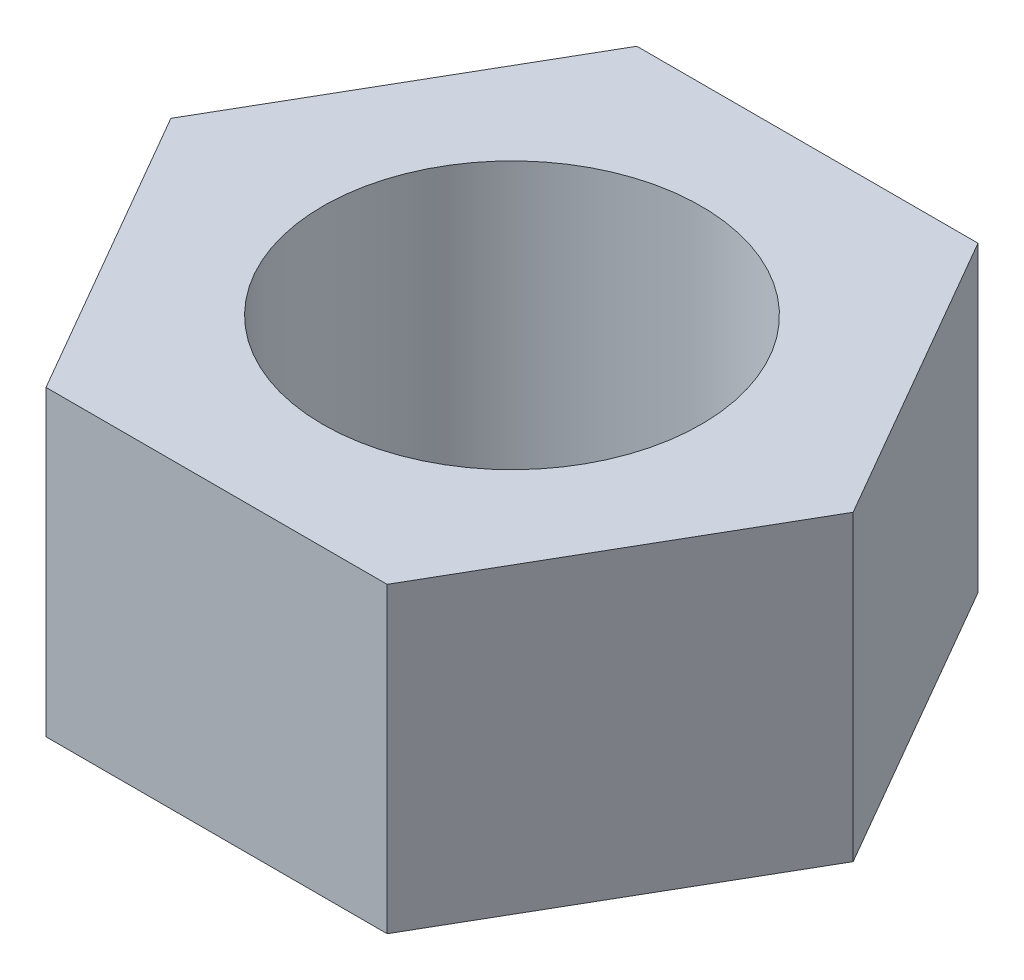
ISO-10303-21;
HEADER;
FILE_DESCRIPTION(('STEP AP214'),'2;1');
FILE_NAME('part.step','',(''),(''),'','','');
FILE_SCHEMA(('AUTOMOTIVE_DESIGN { 1 0 10303 214 1 1 1 1 }'));
ENDSEC;
DATA;
#1=APPLICATION_CONTEXT('core data for automotive mechanical design processes');
#2=APPLICATION_PROTOCOL_DEFINITION('international standard','automotive_design',2000,#1);
#3=PRODUCT_CONTEXT('',#1,'mechanical');
#4=PRODUCT('Part','Part','',(#3));
#5=PRODUCT_RELATED_PRODUCT_CATEGORY('part','',(#4));
#6=PRODUCT_DEFINITION_FORMATION('','',#4);
#7=PRODUCT_DEFINITION_CONTEXT('part definition',#1,'design');
#8=PRODUCT_DEFINITION('design','',#6,#7);
#9=PRODUCT_DEFINITION_SHAPE('','',#8);
#10=(LENGTH_UNIT() NAMED_UNIT(*) SI_UNIT(.MILLI.,.METRE.));
#11=(NAMED_UNIT(*) PLANE_ANGLE_UNIT() SI_UNIT($,.RADIAN.));
#12=(NAMED_UNIT(*) SI_UNIT($,.STERADIAN.) SOLID_ANGLE_UNIT());
#13=UNCERTAINTY_MEASURE_WITH_UNIT(LENGTH_MEASURE(1.E-05),#10,'distance_accuracy_value','');
#14=(GEOMETRIC_REPRESENTATION_CONTEXT(3) GLOBAL_UNCERTAINTY_ASSIGNED_CONTEXT((#13)) GLOBAL_UNIT_ASSIGNED_CONTEXT((#10,
#11,#12)) REPRESENTATION_CONTEXT('',''));
#15=CARTESIAN_POINT('',(0.,0.,0.));
#16=DIRECTION('',(0.,0.,1.));
#17=DIRECTION('',(1.,0.,0.));
#18=AXIS2_PLACEMENT_3D('',#15,#16,#17);
#19=CARTESIAN_POINT('',(0.,4.,0.));
#20=DIRECTION('',(0.,1.,0.));
#21=DIRECTION('',(0.,0.,1.));
#22=AXIS2_PLACEMENT_3D('',#19,#20,#21);
#23=PLANE('',#22);
#24=DIRECTION('',(-1.,0.,0.));
#25=VECTOR('',#24,1.);
#26=CARTESIAN_POINT('',(2.25469713875279,4.,-3.90525));
#27=LINE('',#26,#25);
#28=CARTESIAN_POINT('',(2.25469713875279,4.,-3.90525));
#29=VERTEX_POINT('',#28);
#30=CARTESIAN_POINT('',(-2.25469713875279,4.,-3.90525));
#31=VERTEX_POINT('',#30);
#32=EDGE_CURVE('E129',#29,#31,#27,.T.);
#33=ORIENTED_EDGE('',*,*,#32,.T.);
#34=DIRECTION('',(-0.5,0.,0.866025403784439));
#35=VECTOR('',#34,1.);
#36=CARTESIAN_POINT('',(-2.25469713875279,4.,-3.90525));
#37=LINE('',#36,#35);
#38=CARTESIAN_POINT('',(-4.50939427750557,4.,0.));
#39=VERTEX_POINT('',#38);
#40=EDGE_CURVE('E87',#31,#39,#37,.T.);
#41=ORIENTED_EDGE('',*,*,#40,.T.);
#42=DIRECTION('',(0.5,0.,0.866025403784439));
#43=VECTOR('',#42,1.);
#44=CARTESIAN_POINT('',(-4.50939427750557,4.,0.));
#45=LINE('',#44,#43);
#46=CARTESIAN_POINT('',(-2.25469713875279,4.,3.90525));
#47=VERTEX_POINT('',#46);
#48=EDGE_CURVE('E100',#39,#47,#45,.T.);
#49=ORIENTED_EDGE('',*,*,#48,.T.);
#50=DIRECTION('',(1.,0.,0.));
#51=VECTOR('',#50,1.);
#52=CARTESIAN_POINT('',(-2.25469713875279,4.,3.90525));
#53=LINE('',#52,#51);
#54=CARTESIAN_POINT('',(2.25469713875279,4.,3.90525));
#55=VERTEX_POINT('',#54);
#56=EDGE_CURVE('E94',#47,#55,#53,.T.);
#57=ORIENTED_EDGE('',*,*,#56,.T.);
#58=DIRECTION('',(0.5,0.,-0.866025403784439));
#59=VECTOR('',#58,1.);
#60=CARTESIAN_POINT('',(2.25469713875279,4.,3.90525));
#61=LINE('',#60,#59);
#62=CARTESIAN_POINT('',(4.50939427750557,4.,0.));
#63=VERTEX_POINT('',#62);
#64=EDGE_CURVE('E98',#55,#63,#61,.T.);
#65=ORIENTED_EDGE('',*,*,#64,.T.);
#66=DIRECTION('',(-0.5,0.,-0.866025403784439));
#67=VECTOR('',#66,1.);
#68=CARTESIAN_POINT('',(4.50939427750557,4.,0.));
#69=LINE('',#68,#67);
#70=EDGE_CURVE('E50',#63,#29,#69,.T.);
#71=ORIENTED_EDGE('',*,*,#70,.T.);
#72=EDGE_LOOP('',(#33,#41,#49,#57,#65,#71));
#73=FACE_BOUND('',#72,.T.);
#74=CARTESIAN_POINT('',(0.,4.,0.));
#75=DIRECTION('',(0.,1.,0.));
#76=DIRECTION('',(0.,0.,1.));
#77=AXIS2_PLACEMENT_3D('',#74,#75,#76);
#78=CIRCLE('',#77,2.5);
#79=CARTESIAN_POINT('',(0.,4.,2.5));
#80=VERTEX_POINT('',#79);
#81=EDGE_CURVE('E122',#80,#80,#78,.T.);
#82=ORIENTED_EDGE('',*,*,#81,.F.);
#83=EDGE_LOOP('',(#82));
#84=FACE_BOUND('',#83,.T.);
#85=ADVANCED_FACE('F33',(#73,#84),#23,.T.);
#86=CARTESIAN_POINT('',(0.,0.,0.));
#87=DIRECTION('',(0.,1.,0.));
#88=DIRECTION('',(0.,0.,1.));
#89=AXIS2_PLACEMENT_3D('',#86,#87,#88);
#90=PLANE('',#89);
#91=DIRECTION('',(-1.,0.,0.));
#92=VECTOR('',#91,1.);
#93=CARTESIAN_POINT('',(2.25469713875279,0.,-3.90525));
#94=LINE('',#93,#92);
#95=CARTESIAN_POINT('',(2.25469713875279,0.,-3.90525));
#96=VERTEX_POINT('',#95);
#97=CARTESIAN_POINT('',(-2.25469713875279,0.,-3.90525));
#98=VERTEX_POINT('',#97);
#99=EDGE_CURVE('E118',#96,#98,#94,.T.);
#100=ORIENTED_EDGE('',*,*,#99,.F.);
#101=DIRECTION('',(-0.5,0.,-0.866025403784439));
#102=VECTOR('',#101,1.);
#103=CARTESIAN_POINT('',(4.50939427750557,0.,0.));
#104=LINE('',#103,#102);
#105=CARTESIAN_POINT('',(4.50939427750557,0.,0.));
#106=VERTEX_POINT('',#105);
#107=EDGE_CURVE('E79',#106,#96,#104,.T.);
#108=ORIENTED_EDGE('',*,*,#107,.F.);
#109=DIRECTION('',(0.5,0.,-0.866025403784439));
#110=VECTOR('',#109,1.);
#111=CARTESIAN_POINT('',(2.25469713875279,0.,3.90525));
#112=LINE('',#111,#110);
#113=CARTESIAN_POINT('',(2.25469713875279,0.,3.90525));
#114=VERTEX_POINT('',#113);
#115=EDGE_CURVE('E73',#114,#106,#112,.T.);
#116=ORIENTED_EDGE('',*,*,#115,.F.);
#117=DIRECTION('',(1.,0.,0.));
#118=VECTOR('',#117,1.);
#119=CARTESIAN_POINT('',(-2.25469713875279,0.,3.90525));
#120=LINE('',#119,#118);
#121=CARTESIAN_POINT('',(-2.25469713875279,0.,3.90525));
#122=VERTEX_POINT('',#121);
#123=EDGE_CURVE('E108',#122,#114,#120,.T.);
#124=ORIENTED_EDGE('',*,*,#123,.F.);
#125=DIRECTION('',(0.5,0.,0.866025403784439));
#126=VECTOR('',#125,1.);
#127=CARTESIAN_POINT('',(-4.50939427750557,0.,0.));
#128=LINE('',#127,#126);
#129=CARTESIAN_POINT('',(-4.50939427750557,0.,0.));
#130=VERTEX_POINT('',#129);
#131=EDGE_CURVE('E124',#130,#122,#128,.T.);
#132=ORIENTED_EDGE('',*,*,#131,.F.);
#133=DIRECTION('',(-0.5,0.,0.866025403784439));
#134=VECTOR('',#133,1.);
#135=CARTESIAN_POINT('',(-2.25469713875279,0.,-3.90525));
#136=LINE('',#135,#134);
#137=EDGE_CURVE('E121',#98,#130,#136,.T.);
#138=ORIENTED_EDGE('',*,*,#137,.F.);
#139=EDGE_LOOP('',(#100,#108,#116,#124,#132,#138));
#140=FACE_BOUND('',#139,.T.);
#141=CARTESIAN_POINT('',(0.,0.,0.));
#142=DIRECTION('',(0.,1.,0.));
#143=DIRECTION('',(0.,0.,1.));
#144=AXIS2_PLACEMENT_3D('',#141,#142,#143);
#145=CIRCLE('',#144,2.5);
#146=CARTESIAN_POINT('',(0.,0.,2.5));
#147=VERTEX_POINT('',#146);
#148=EDGE_CURVE('E222',#147,#147,#145,.T.);
#149=ORIENTED_EDGE('',*,*,#148,.T.);
#150=EDGE_LOOP('',(#149));
#151=FACE_BOUND('',#150,.T.);
#152=ADVANCED_FACE('F138',(#140,#151),#90,.F.);
#153=CARTESIAN_POINT('',(2.25469713875279,4.,-3.90525));
#154=DIRECTION('',(0.,0.,1.));
#155=DIRECTION('',(1.,0.,0.));
#156=AXIS2_PLACEMENT_3D('',#153,#154,#155);
#157=PLANE('',#156);
#158=ORIENTED_EDGE('',*,*,#99,.T.);
#159=DIRECTION('',(0.,-1.,0.));
#160=VECTOR('',#159,1.);
#161=CARTESIAN_POINT('',(-2.25469713875279,4.,-3.90525));
#162=LINE('',#161,#160);
#163=EDGE_CURVE('E11',#31,#98,#162,.T.);
#164=ORIENTED_EDGE('',*,*,#163,.F.);
#165=ORIENTED_EDGE('',*,*,#32,.F.);
#166=DIRECTION('',(0.,-1.,0.));
#167=VECTOR('',#166,1.);
#168=CARTESIAN_POINT('',(2.25469713875279,4.,-3.90525));
#169=LINE('',#168,#167);
#170=EDGE_CURVE('E114',#29,#96,#169,.T.);
#171=ORIENTED_EDGE('',*,*,#170,.T.);
#172=EDGE_LOOP('',(#158,#164,#165,#171));
#173=FACE_BOUND('',#172,.T.);
#174=ADVANCED_FACE('F35',(#173),#157,.F.);
#175=CARTESIAN_POINT('',(-2.25469713875279,4.,-3.90525));
#176=DIRECTION('',(0.866025403784439,0.,0.5));
#177=DIRECTION('',(0.5,0.,-0.866025403784439));
#178=AXIS2_PLACEMENT_3D('',#175,#176,#177);
#179=PLANE('',#178);
#180=ORIENTED_EDGE('',*,*,#137,.T.);
#181=DIRECTION('',(0.,-1.,0.));
#182=VECTOR('',#181,1.);
#183=CARTESIAN_POINT('',(-4.50939427750557,4.,0.));
#184=LINE('',#183,#182);
#185=EDGE_CURVE('E42',#39,#130,#184,.T.);
#186=ORIENTED_EDGE('',*,*,#185,.F.);
#187=ORIENTED_EDGE('',*,*,#40,.F.);
#188=ORIENTED_EDGE('',*,*,#163,.T.);
#189=EDGE_LOOP('',(#180,#186,#187,#188));
#190=FACE_BOUND('',#189,.T.);
#191=ADVANCED_FACE('F163',(#190),#179,.F.);
#192=CARTESIAN_POINT('',(-4.50939427750557,4.,0.));
#193=DIRECTION('',(0.866025403784439,0.,-0.5));
#194=DIRECTION('',(-0.5,0.,-0.866025403784439));
#195=AXIS2_PLACEMENT_3D('',#192,#193,#194);
#196=PLANE('',#195);
#197=ORIENTED_EDGE('',*,*,#131,.T.);
#198=DIRECTION('',(0.,-1.,0.));
#199=VECTOR('',#198,1.);
#200=CARTESIAN_POINT('',(-2.25469713875279,4.,3.90525));
#201=LINE('',#200,#199);
#202=EDGE_CURVE('E109',#47,#122,#201,.T.);
#203=ORIENTED_EDGE('',*,*,#202,.F.);
#204=ORIENTED_EDGE('',*,*,#48,.F.);
#205=ORIENTED_EDGE('',*,*,#185,.T.);
#206=EDGE_LOOP('',(#197,#203,#204,#205));
#207=FACE_BOUND('',#206,.T.);
#208=ADVANCED_FACE('F135',(#207),#196,.F.);
#209=CARTESIAN_POINT('',(-2.25469713875279,4.,3.90525));
#210=DIRECTION('',(0.,0.,-1.));
#211=DIRECTION('',(-1.,0.,0.));
#212=AXIS2_PLACEMENT_3D('',#209,#210,#211);
#213=PLANE('',#212);
#214=ORIENTED_EDGE('',*,*,#123,.T.);
#215=DIRECTION('',(0.,-1.,0.));
#216=VECTOR('',#215,1.);
#217=CARTESIAN_POINT('',(2.25469713875279,4.,3.90525));
#218=LINE('',#217,#216);
#219=EDGE_CURVE('E105',#55,#114,#218,.T.);
#220=ORIENTED_EDGE('',*,*,#219,.F.);
#221=ORIENTED_EDGE('',*,*,#56,.F.);
#222=ORIENTED_EDGE('',*,*,#202,.T.);
#223=EDGE_LOOP('',(#214,#220,#221,#222));
#224=FACE_BOUND('',#223,.T.);
#225=ADVANCED_FACE('F106',(#224),#213,.F.);
#226=CARTESIAN_POINT('',(2.25469713875279,4.,3.90525));
#227=DIRECTION('',(-0.866025403784439,0.,-0.5));
#228=DIRECTION('',(-0.5,0.,0.866025403784439));
#229=AXIS2_PLACEMENT_3D('',#226,#227,#228);
#230=PLANE('',#229);
#231=ORIENTED_EDGE('',*,*,#115,.T.);
#232=DIRECTION('',(0.,-1.,0.));
#233=VECTOR('',#232,1.);
#234=CARTESIAN_POINT('',(4.50939427750557,4.,0.));
#235=LINE('',#234,#233);
#236=EDGE_CURVE('E110',#63,#106,#235,.T.);
#237=ORIENTED_EDGE('',*,*,#236,.F.);
#238=ORIENTED_EDGE('',*,*,#64,.F.);
#239=ORIENTED_EDGE('',*,*,#219,.T.);
#240=EDGE_LOOP('',(#231,#237,#238,#239));
#241=FACE_BOUND('',#240,.T.);
#242=ADVANCED_FACE('F112',(#241),#230,.F.);
#243=CARTESIAN_POINT('',(4.50939427750557,4.,0.));
#244=DIRECTION('',(-0.866025403784439,0.,0.5));
#245=DIRECTION('',(0.5,0.,0.866025403784439));
#246=AXIS2_PLACEMENT_3D('',#243,#244,#245);
#247=PLANE('',#246);
#248=ORIENTED_EDGE('',*,*,#107,.T.);
#249=ORIENTED_EDGE('',*,*,#170,.F.);
#250=ORIENTED_EDGE('',*,*,#70,.F.);
#251=ORIENTED_EDGE('',*,*,#236,.T.);
#252=EDGE_LOOP('',(#248,#249,#250,#251));
#253=FACE_BOUND('',#252,.T.);
#254=ADVANCED_FACE('F143',(#253),#247,.F.);
#255=CARTESIAN_POINT('',(0.,4.,0.));
#256=DIRECTION('',(0.,-1.,0.));
#257=DIRECTION('',(0.,0.,-1.));
#258=AXIS2_PLACEMENT_3D('',#255,#256,#257);
#259=CYLINDRICAL_SURFACE('',#258,2.5);
#260=ORIENTED_EDGE('',*,*,#81,.T.);
#261=EDGE_LOOP('',(#260));
#262=FACE_BOUND('',#261,.T.);
#263=ORIENTED_EDGE('',*,*,#148,.F.);
#264=EDGE_LOOP('',(#263));
#265=FACE_BOUND('',#264,.T.);
#266=ADVANCED_FACE('F145',(#262,#265),#259,.F.);
#267=CLOSED_SHELL('',(#85,#152,#174,#191,#208,#225,#242,#254,#266));
#268=MANIFOLD_SOLID_BREP('B2',#267);
#269=ADVANCED_BREP_SHAPE_REPRESENTATION('',(#18,#268),#14);
#270=SHAPE_DEFINITION_REPRESENTATION(#9,#269);
ENDSEC;
END-ISO-10303-21;
